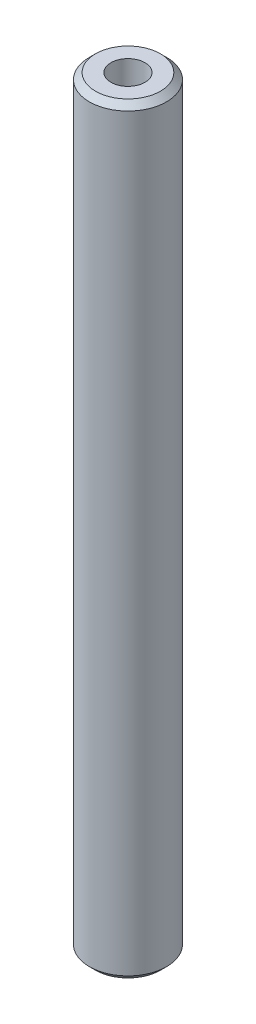
ISO-10303-21;
HEADER;
FILE_DESCRIPTION(('STEP AP214'),'2;1');
FILE_NAME('part.step','',(''),(''),'','','');
FILE_SCHEMA(('AUTOMOTIVE_DESIGN { 1 0 10303 214 1 1 1 1 }'));
ENDSEC;
DATA;
#1=APPLICATION_CONTEXT('core data for automotive mechanical design processes');
#2=APPLICATION_PROTOCOL_DEFINITION('international standard','automotive_design',2000,#1);
#3=PRODUCT_CONTEXT('',#1,'mechanical');
#4=PRODUCT('Part','Part','',(#3));
#5=PRODUCT_RELATED_PRODUCT_CATEGORY('part','',(#4));
#6=PRODUCT_DEFINITION_FORMATION('','',#4);
#7=PRODUCT_DEFINITION_CONTEXT('part definition',#1,'design');
#8=PRODUCT_DEFINITION('design','',#6,#7);
#9=PRODUCT_DEFINITION_SHAPE('','',#8);
#10=(LENGTH_UNIT() NAMED_UNIT(*) SI_UNIT(.MILLI.,.METRE.));
#11=(NAMED_UNIT(*) PLANE_ANGLE_UNIT() SI_UNIT($,.RADIAN.));
#12=(NAMED_UNIT(*) SI_UNIT($,.STERADIAN.) SOLID_ANGLE_UNIT());
#13=UNCERTAINTY_MEASURE_WITH_UNIT(LENGTH_MEASURE(1.E-05),#10,'distance_accuracy_value','');
#14=(GEOMETRIC_REPRESENTATION_CONTEXT(3) GLOBAL_UNCERTAINTY_ASSIGNED_CONTEXT((#13)) GLOBAL_UNIT_ASSIGNED_CONTEXT((#10,
#11,#12)) REPRESENTATION_CONTEXT('',''));
#15=CARTESIAN_POINT('',(0.,0.,0.));
#16=DIRECTION('',(0.,0.,1.));
#17=DIRECTION('',(1.,0.,0.));
#18=AXIS2_PLACEMENT_3D('',#15,#16,#17);
#19=CARTESIAN_POINT('',(0.,98.6365176942838,0.));
#20=DIRECTION('',(0.,-1.,0.));
#21=DIRECTION('',(0.,0.,-1.));
#22=AXIS2_PLACEMENT_3D('',#19,#20,#21);
#23=CYLINDRICAL_SURFACE('',#22,5.);
#24=CARTESIAN_POINT('',(0.,97.84075486766,0.));
#25=DIRECTION('',(0.,1.,0.));
#26=DIRECTION('',(0.,0.,1.));
#27=AXIS2_PLACEMENT_3D('',#24,#25,#26);
#28=CIRCLE('',#27,5.);
#29=CARTESIAN_POINT('',(0.,97.84075486766,5.));
#30=VERTEX_POINT('',#29);
#31=EDGE_CURVE('E50',#30,#30,#28,.F.);
#32=ORIENTED_EDGE('',*,*,#31,.T.);
#33=EDGE_LOOP('',(#32));
#34=FACE_BOUND('',#33,.T.);
#35=CARTESIAN_POINT('',(0.,0.795762826623761,0.));
#36=DIRECTION('',(0.,1.,0.));
#37=DIRECTION('',(0.,0.,1.));
#38=AXIS2_PLACEMENT_3D('',#35,#36,#37);
#39=CIRCLE('',#38,5.);
#40=CARTESIAN_POINT('',(0.,0.795762826623761,5.));
#41=VERTEX_POINT('',#40);
#42=EDGE_CURVE('E51',#41,#41,#39,.T.);
#43=ORIENTED_EDGE('',*,*,#42,.T.);
#44=EDGE_LOOP('',(#43));
#45=FACE_BOUND('',#44,.T.);
#46=ADVANCED_FACE('F39',(#34,#45),#23,.T.);
#47=CARTESIAN_POINT('',(0.,98.6365176942838,0.));
#48=DIRECTION('',(0.,1.,0.));
#49=DIRECTION('',(0.,0.,1.));
#50=AXIS2_PLACEMENT_3D('',#47,#48,#49);
#51=PLANE('',#50);
#52=CARTESIAN_POINT('',(0.,98.6365176942838,0.));
#53=DIRECTION('',(0.,1.,0.));
#54=DIRECTION('',(0.,0.,1.));
#55=AXIS2_PLACEMENT_3D('',#52,#53,#54);
#56=CIRCLE('',#55,4.20423717337622);
#57=CARTESIAN_POINT('',(0.,98.6365176942838,4.20423717337622));
#58=VERTEX_POINT('',#57);
#59=EDGE_CURVE('E54',#58,#58,#56,.T.);
#60=ORIENTED_EDGE('',*,*,#59,.T.);
#61=EDGE_LOOP('',(#60));
#62=FACE_BOUND('',#61,.T.);
#63=CARTESIAN_POINT('',(0.,98.6365176942838,0.));
#64=DIRECTION('',(0.,1.,0.));
#65=DIRECTION('',(0.,0.,1.));
#66=AXIS2_PLACEMENT_3D('',#63,#64,#65);
#67=CIRCLE('',#66,2.20736390100712);
#68=CARTESIAN_POINT('',(0.,98.6365176942838,2.20736390100712));
#69=VERTEX_POINT('',#68);
#70=EDGE_CURVE('E58',#69,#69,#67,.T.);
#71=ORIENTED_EDGE('',*,*,#70,.F.);
#72=EDGE_LOOP('',(#71));
#73=FACE_BOUND('',#72,.T.);
#74=ADVANCED_FACE('F69',(#62,#73),#51,.T.);
#75=CARTESIAN_POINT('',(0.,0.,0.));
#76=DIRECTION('',(0.,1.,0.));
#77=DIRECTION('',(0.,0.,1.));
#78=AXIS2_PLACEMENT_3D('',#75,#76,#77);
#79=PLANE('',#78);
#80=CARTESIAN_POINT('',(0.,0.,0.));
#81=DIRECTION('',(0.,1.,0.));
#82=DIRECTION('',(0.,0.,1.));
#83=AXIS2_PLACEMENT_3D('',#80,#81,#82);
#84=CIRCLE('',#83,4.20423717337623);
#85=CARTESIAN_POINT('',(0.,0.,4.20423717337623));
#86=VERTEX_POINT('',#85);
#87=EDGE_CURVE('E10',#86,#86,#84,.F.);
#88=ORIENTED_EDGE('',*,*,#87,.T.);
#89=EDGE_LOOP('',(#88));
#90=FACE_BOUND('',#89,.T.);
#91=CARTESIAN_POINT('',(0.,0.,0.));
#92=DIRECTION('',(0.,1.,0.));
#93=DIRECTION('',(0.,0.,1.));
#94=AXIS2_PLACEMENT_3D('',#91,#92,#93);
#95=CIRCLE('',#94,2.20736390100712);
#96=CARTESIAN_POINT('',(0.,0.,2.20736390100712));
#97=VERTEX_POINT('',#96);
#98=EDGE_CURVE('E63',#97,#97,#95,.T.);
#99=ORIENTED_EDGE('',*,*,#98,.T.);
#100=EDGE_LOOP('',(#99));
#101=FACE_BOUND('',#100,.T.);
#102=ADVANCED_FACE('F75',(#90,#101),#79,.F.);
#103=CARTESIAN_POINT('',(0.,98.6365176942838,0.));
#104=DIRECTION('',(0.,-1.,0.));
#105=DIRECTION('',(0.,0.,-1.));
#106=AXIS2_PLACEMENT_3D('',#103,#104,#105);
#107=CYLINDRICAL_SURFACE('',#106,2.20736390100712);
#108=ORIENTED_EDGE('',*,*,#70,.T.);
#109=EDGE_LOOP('',(#108));
#110=FACE_BOUND('',#109,.T.);
#111=ORIENTED_EDGE('',*,*,#98,.F.);
#112=EDGE_LOOP('',(#111));
#113=FACE_BOUND('',#112,.T.);
#114=ADVANCED_FACE('F70',(#110,#113),#107,.F.);
#115=CARTESIAN_POINT('',(0.,98.6365176942838,0.));
#116=DIRECTION('',(0.,-1.,0.));
#117=DIRECTION('',(0.,0.,-1.));
#118=AXIS2_PLACEMENT_3D('',#115,#116,#117);
#119=CONICAL_SURFACE('',#118,4.20423717337622,0.785398163397446);
#120=ORIENTED_EDGE('',*,*,#31,.F.);
#121=EDGE_LOOP('',(#120));
#122=FACE_BOUND('',#121,.T.);
#123=ORIENTED_EDGE('',*,*,#59,.F.);
#124=EDGE_LOOP('',(#123));
#125=FACE_BOUND('',#124,.T.);
#126=ADVANCED_FACE('F81',(#122,#125),#119,.T.);
#127=CARTESIAN_POINT('',(0.,0.795762826623761,0.));
#128=DIRECTION('',(0.,1.,0.));
#129=DIRECTION('',(0.,0.,1.));
#130=AXIS2_PLACEMENT_3D('',#127,#128,#129);
#131=CONICAL_SURFACE('',#130,5.,0.785398163397454);
#132=ORIENTED_EDGE('',*,*,#87,.F.);
#133=EDGE_LOOP('',(#132));
#134=FACE_BOUND('',#133,.T.);
#135=ORIENTED_EDGE('',*,*,#42,.F.);
#136=EDGE_LOOP('',(#135));
#137=FACE_BOUND('',#136,.T.);
#138=ADVANCED_FACE('F45',(#134,#137),#131,.T.);
#139=CLOSED_SHELL('',(#46,#74,#102,#114,#126,#138));
#140=MANIFOLD_SOLID_BREP('B2',#139);
#141=ADVANCED_BREP_SHAPE_REPRESENTATION('',(#18,#140),#14);
#142=SHAPE_DEFINITION_REPRESENTATION(#9,#141);
ENDSEC;
END-ISO-10303-21;
